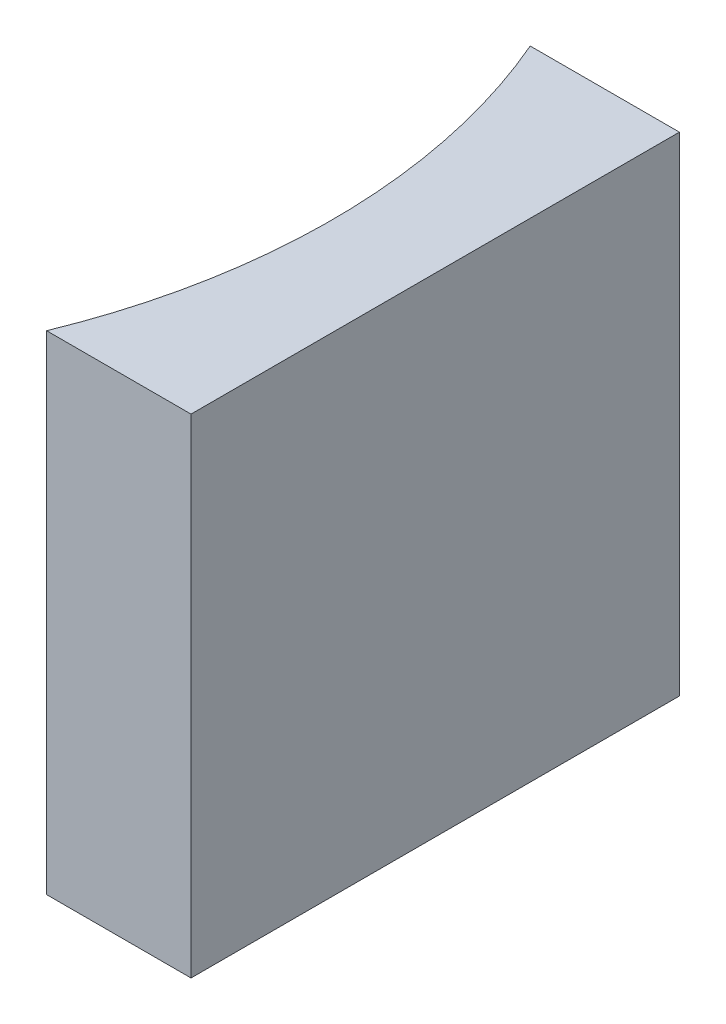
ISO-10303-21;
HEADER;
FILE_DESCRIPTION(('STEP AP214'),'2;1');
FILE_NAME('part.step','',(''),(''),'','','');
FILE_SCHEMA(('AUTOMOTIVE_DESIGN { 1 0 10303 214 1 1 1 1 }'));
ENDSEC;
DATA;
#1=APPLICATION_CONTEXT('core data for automotive mechanical design processes');
#2=APPLICATION_PROTOCOL_DEFINITION('international standard','automotive_design',2000,#1);
#3=PRODUCT_CONTEXT('',#1,'mechanical');
#4=PRODUCT('Part','Part','',(#3));
#5=PRODUCT_RELATED_PRODUCT_CATEGORY('part','',(#4));
#6=PRODUCT_DEFINITION_FORMATION('','',#4);
#7=PRODUCT_DEFINITION_CONTEXT('part definition',#1,'design');
#8=PRODUCT_DEFINITION('design','',#6,#7);
#9=PRODUCT_DEFINITION_SHAPE('','',#8);
#10=(LENGTH_UNIT() NAMED_UNIT(*) SI_UNIT(.MILLI.,.METRE.));
#11=(NAMED_UNIT(*) PLANE_ANGLE_UNIT() SI_UNIT($,.RADIAN.));
#12=(NAMED_UNIT(*) SI_UNIT($,.STERADIAN.) SOLID_ANGLE_UNIT());
#13=UNCERTAINTY_MEASURE_WITH_UNIT(LENGTH_MEASURE(1.E-05),#10,'distance_accuracy_value','');
#14=(GEOMETRIC_REPRESENTATION_CONTEXT(3) GLOBAL_UNCERTAINTY_ASSIGNED_CONTEXT((#13)) GLOBAL_UNIT_ASSIGNED_CONTEXT((#10,
#11,#12)) REPRESENTATION_CONTEXT('',''));
#15=CARTESIAN_POINT('',(0.,0.,0.));
#16=DIRECTION('',(0.,0.,1.));
#17=DIRECTION('',(1.,0.,0.));
#18=AXIS2_PLACEMENT_3D('',#15,#16,#17);
#19=CARTESIAN_POINT('',(0.,10.,0.));
#20=DIRECTION('',(0.,0.,1.));
#21=DIRECTION('',(1.,0.,0.));
#22=AXIS2_PLACEMENT_3D('',#19,#20,#21);
#23=PLANE('',#22);
#24=DIRECTION('',(-1.,0.,0.));
#25=VECTOR('',#24,1.);
#26=CARTESIAN_POINT('',(0.,0.,0.));
#27=LINE('',#26,#25);
#28=CARTESIAN_POINT('',(0.,0.,0.));
#29=VERTEX_POINT('',#28);
#30=CARTESIAN_POINT('',(-3.05477949203226,0.,0.));
#31=VERTEX_POINT('',#30);
#32=EDGE_CURVE('E100',#29,#31,#27,.T.);
#33=ORIENTED_EDGE('',*,*,#32,.T.);
#34=DIRECTION('',(0.,-1.,0.));
#35=VECTOR('',#34,1.);
#36=CARTESIAN_POINT('',(-3.05477949203226,10.,0.));
#37=LINE('',#36,#35);
#38=CARTESIAN_POINT('',(-3.05477949203226,10.,0.));
#39=VERTEX_POINT('',#38);
#40=EDGE_CURVE('E11',#39,#31,#37,.T.);
#41=ORIENTED_EDGE('',*,*,#40,.F.);
#42=DIRECTION('',(-1.,0.,0.));
#43=VECTOR('',#42,1.);
#44=CARTESIAN_POINT('',(0.,10.,0.));
#45=LINE('',#44,#43);
#46=CARTESIAN_POINT('',(0.,10.,0.));
#47=VERTEX_POINT('',#46);
#48=EDGE_CURVE('E88',#47,#39,#45,.T.);
#49=ORIENTED_EDGE('',*,*,#48,.F.);
#50=DIRECTION('',(0.,-1.,0.));
#51=VECTOR('',#50,1.);
#52=CARTESIAN_POINT('',(0.,10.,0.));
#53=LINE('',#52,#51);
#54=EDGE_CURVE('E96',#47,#29,#53,.T.);
#55=ORIENTED_EDGE('',*,*,#54,.T.);
#56=EDGE_LOOP('',(#33,#41,#49,#55));
#57=FACE_BOUND('',#56,.T.);
#58=ADVANCED_FACE('F37',(#57),#23,.F.);
#59=CARTESIAN_POINT('',(-14.9293579398562,10.,5.11656981643711));
#60=DIRECTION('',(0.,-1.,0.));
#61=DIRECTION('',(0.,0.,-1.));
#62=AXIS2_PLACEMENT_3D('',#59,#60,#61);
#63=CYLINDRICAL_SURFACE('',#62,12.93);
#64=CARTESIAN_POINT('',(-14.9293579398562,0.,5.11656981643711));
#65=DIRECTION('',(0.,-1.,0.));
#66=DIRECTION('',(0.,0.,1.));
#67=AXIS2_PLACEMENT_3D('',#64,#65,#66);
#68=CIRCLE('',#67,12.93);
#69=CARTESIAN_POINT('',(-2.9570144081049,0.,10.));
#70=VERTEX_POINT('',#69);
#71=EDGE_CURVE('E92',#31,#70,#68,.T.);
#72=ORIENTED_EDGE('',*,*,#71,.T.);
#73=DIRECTION('',(0.,-1.,0.));
#74=VECTOR('',#73,1.);
#75=CARTESIAN_POINT('',(-2.9570144081049,10.,10.));
#76=LINE('',#75,#74);
#77=CARTESIAN_POINT('',(-2.9570144081049,10.,10.));
#78=VERTEX_POINT('',#77);
#79=EDGE_CURVE('E45',#78,#70,#76,.T.);
#80=ORIENTED_EDGE('',*,*,#79,.F.);
#81=CARTESIAN_POINT('',(-14.9293579398562,10.,5.11656981643711));
#82=DIRECTION('',(0.,-1.,0.));
#83=DIRECTION('',(0.,0.,1.));
#84=AXIS2_PLACEMENT_3D('',#81,#82,#83);
#85=CIRCLE('',#84,12.93);
#86=EDGE_CURVE('E83',#39,#78,#85,.T.);
#87=ORIENTED_EDGE('',*,*,#86,.F.);
#88=ORIENTED_EDGE('',*,*,#40,.T.);
#89=EDGE_LOOP('',(#72,#80,#87,#88));
#90=FACE_BOUND('',#89,.T.);
#91=ADVANCED_FACE('F91',(#90),#63,.F.);
#92=CARTESIAN_POINT('',(0.,10.,10.));
#93=DIRECTION('',(0.,0.,-1.));
#94=DIRECTION('',(-1.,0.,0.));
#95=AXIS2_PLACEMENT_3D('',#92,#93,#94);
#96=PLANE('',#95);
#97=DIRECTION('',(1.,0.,0.));
#98=VECTOR('',#97,1.);
#99=CARTESIAN_POINT('',(0.,0.,10.));
#100=LINE('',#99,#98);
#101=CARTESIAN_POINT('',(0.,0.,10.));
#102=VERTEX_POINT('',#101);
#103=EDGE_CURVE('E70',#70,#102,#100,.T.);
#104=ORIENTED_EDGE('',*,*,#103,.T.);
#105=DIRECTION('',(0.,-1.,0.));
#106=VECTOR('',#105,1.);
#107=CARTESIAN_POINT('',(0.,10.,10.));
#108=LINE('',#107,#106);
#109=CARTESIAN_POINT('',(0.,10.,10.));
#110=VERTEX_POINT('',#109);
#111=EDGE_CURVE('E93',#110,#102,#108,.T.);
#112=ORIENTED_EDGE('',*,*,#111,.F.);
#113=DIRECTION('',(1.,0.,0.));
#114=VECTOR('',#113,1.);
#115=CARTESIAN_POINT('',(0.,10.,10.));
#116=LINE('',#115,#114);
#117=EDGE_CURVE('E86',#78,#110,#116,.T.);
#118=ORIENTED_EDGE('',*,*,#117,.F.);
#119=ORIENTED_EDGE('',*,*,#79,.T.);
#120=EDGE_LOOP('',(#104,#112,#118,#119));
#121=FACE_BOUND('',#120,.T.);
#122=ADVANCED_FACE('F94',(#121),#96,.F.);
#123=CARTESIAN_POINT('',(0.,10.,0.));
#124=DIRECTION('',(-1.,0.,0.));
#125=DIRECTION('',(0.,0.,1.));
#126=AXIS2_PLACEMENT_3D('',#123,#124,#125);
#127=PLANE('',#126);
#128=DIRECTION('',(0.,0.,-1.));
#129=VECTOR('',#128,1.);
#130=CARTESIAN_POINT('',(0.,0.,0.));
#131=LINE('',#130,#129);
#132=EDGE_CURVE('E76',#102,#29,#131,.T.);
#133=ORIENTED_EDGE('',*,*,#132,.T.);
#134=ORIENTED_EDGE('',*,*,#54,.F.);
#135=DIRECTION('',(0.,0.,-1.));
#136=VECTOR('',#135,1.);
#137=CARTESIAN_POINT('',(0.,10.,0.));
#138=LINE('',#137,#136);
#139=EDGE_CURVE('E53',#110,#47,#138,.T.);
#140=ORIENTED_EDGE('',*,*,#139,.F.);
#141=ORIENTED_EDGE('',*,*,#111,.T.);
#142=EDGE_LOOP('',(#133,#134,#140,#141));
#143=FACE_BOUND('',#142,.T.);
#144=ADVANCED_FACE('F107',(#143),#127,.F.);
#145=CARTESIAN_POINT('',(-14.9293579398562,10.,5.11656981643711));
#146=DIRECTION('',(0.,1.,0.));
#147=DIRECTION('',(0.,0.,1.));
#148=AXIS2_PLACEMENT_3D('',#145,#146,#147);
#149=PLANE('',#148);
#150=ORIENTED_EDGE('',*,*,#48,.T.);
#151=ORIENTED_EDGE('',*,*,#86,.T.);
#152=ORIENTED_EDGE('',*,*,#117,.T.);
#153=ORIENTED_EDGE('',*,*,#139,.T.);
#154=EDGE_LOOP('',(#150,#151,#152,#153));
#155=FACE_BOUND('',#154,.T.);
#156=ADVANCED_FACE('F84',(#155),#149,.T.);
#157=CARTESIAN_POINT('',(-14.9293579398562,0.,5.11656981643711));
#158=DIRECTION('',(0.,1.,0.));
#159=DIRECTION('',(0.,0.,1.));
#160=AXIS2_PLACEMENT_3D('',#157,#158,#159);
#161=PLANE('',#160);
#162=ORIENTED_EDGE('',*,*,#32,.F.);
#163=ORIENTED_EDGE('',*,*,#132,.F.);
#164=ORIENTED_EDGE('',*,*,#103,.F.);
#165=ORIENTED_EDGE('',*,*,#71,.F.);
#166=EDGE_LOOP('',(#162,#163,#164,#165));
#167=FACE_BOUND('',#166,.T.);
#168=ADVANCED_FACE('F110',(#167),#161,.F.);
#169=CLOSED_SHELL('',(#58,#91,#122,#144,#156,#168));
#170=MANIFOLD_SOLID_BREP('B2',#169);
#171=ADVANCED_BREP_SHAPE_REPRESENTATION('',(#18,#170),#14);
#172=SHAPE_DEFINITION_REPRESENTATION(#9,#171);
ENDSEC;
END-ISO-10303-21;
